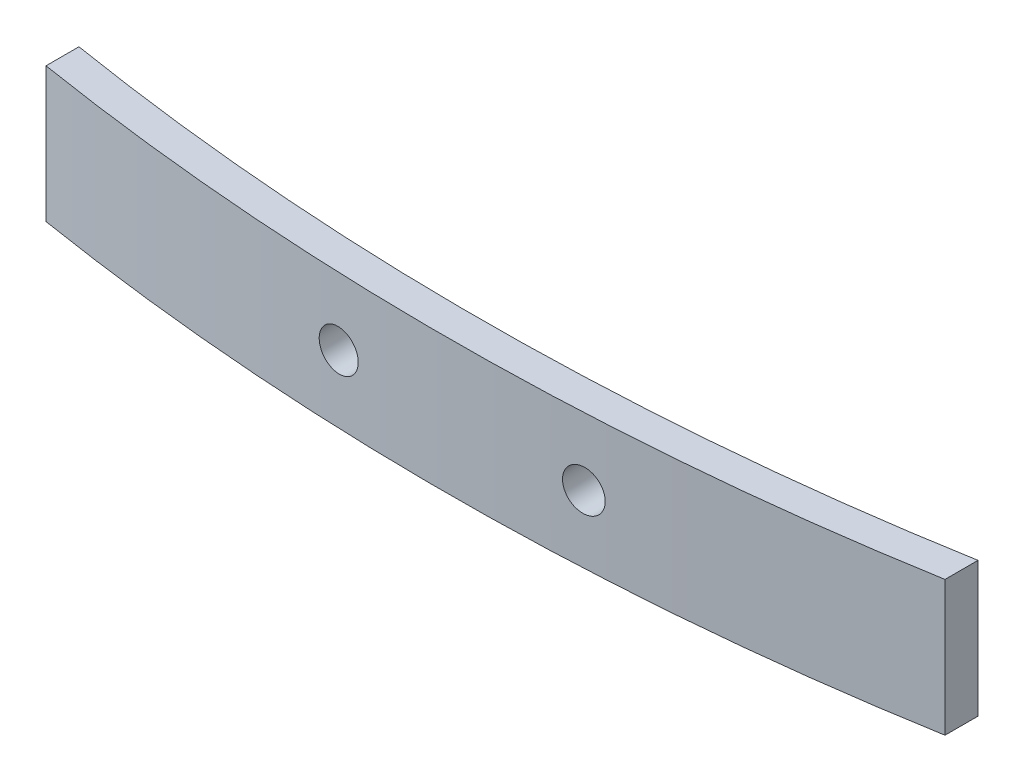
ISO-10303-21;
HEADER;
FILE_DESCRIPTION(('STEP AP214'),'2;1');
FILE_NAME('part.step','',(''),(''),'','','');
FILE_SCHEMA(('AUTOMOTIVE_DESIGN { 1 0 10303 214 1 1 1 1 }'));
ENDSEC;
DATA;
#1=APPLICATION_CONTEXT('core data for automotive mechanical design processes');
#2=APPLICATION_PROTOCOL_DEFINITION('international standard','automotive_design',2000,#1);
#3=PRODUCT_CONTEXT('',#1,'mechanical');
#4=PRODUCT('Part','Part','',(#3));
#5=PRODUCT_RELATED_PRODUCT_CATEGORY('part','',(#4));
#6=PRODUCT_DEFINITION_FORMATION('','',#4);
#7=PRODUCT_DEFINITION_CONTEXT('part definition',#1,'design');
#8=PRODUCT_DEFINITION('design','',#6,#7);
#9=PRODUCT_DEFINITION_SHAPE('','',#8);
#10=(LENGTH_UNIT() NAMED_UNIT(*) SI_UNIT(.MILLI.,.METRE.));
#11=(NAMED_UNIT(*) PLANE_ANGLE_UNIT() SI_UNIT($,.RADIAN.));
#12=(NAMED_UNIT(*) SI_UNIT($,.STERADIAN.) SOLID_ANGLE_UNIT());
#13=UNCERTAINTY_MEASURE_WITH_UNIT(LENGTH_MEASURE(1.E-05),#10,'distance_accuracy_value','');
#14=(GEOMETRIC_REPRESENTATION_CONTEXT(3) GLOBAL_UNCERTAINTY_ASSIGNED_CONTEXT((#13)) GLOBAL_UNIT_ASSIGNED_CONTEXT((#10,
#11,#12)) REPRESENTATION_CONTEXT('',''));
#15=CARTESIAN_POINT('',(0.,0.,0.));
#16=DIRECTION('',(0.,0.,1.));
#17=DIRECTION('',(1.,0.,0.));
#18=AXIS2_PLACEMENT_3D('',#15,#16,#17);
#19=CARTESIAN_POINT('',(-0.864955357142889,8.3,-164.510629845203));
#20=DIRECTION('',(0.,-1.,0.));
#21=DIRECTION('',(0.,0.,-1.));
#22=AXIS2_PLACEMENT_3D('',#19,#20,#21);
#23=CYLINDRICAL_SURFACE('',#22,165.210703971618);
#24=CARTESIAN_POINT('',(8.75,4.15,0.420050564105878));
#25=CARTESIAN_POINT('',(8.7499968756701,4.22012785151778,0.420050786641391));
#26=CARTESIAN_POINT('',(8.74407852912759,4.29030657591266,0.420396098331582));
#27=CARTESIAN_POINT('',(8.72055304510893,4.42872948848566,0.421764998652113));
#28=CARTESIAN_POINT('',(8.70293184075388,4.49697124536185,0.422789403552308));
#29=CARTESIAN_POINT('',(8.65650809093418,4.62949303841441,0.425475899042389));
#30=CARTESIAN_POINT('',(8.62771132313101,4.69377510184941,0.427137660119922));
#31=CARTESIAN_POINT('',(8.55976687690109,4.81657159404113,0.431033993499513));
#32=CARTESIAN_POINT('',(8.52062172919151,4.87508742814449,0.433268425749609));
#33=CARTESIAN_POINT('',(8.43305223614725,4.98477091182553,0.438227928441563));
#34=CARTESIAN_POINT('',(8.38461943762333,5.0359317924697,0.440953445708677));
#35=CARTESIAN_POINT('',(8.27987264209871,5.12940091687988,0.446793671892669));
#36=CARTESIAN_POINT('',(8.22355827497798,5.17170874467183,0.449908399086186));
#37=CARTESIAN_POINT('',(8.10455421106636,5.24633687235545,0.456421883334665));
#38=CARTESIAN_POINT('',(8.04185485362085,5.27864172993917,0.459821069355649));
#39=CARTESIAN_POINT('',(7.91193085692122,5.3322656283006,0.466784376452274));
#40=CARTESIAN_POINT('',(7.84470619336023,5.35358461006432,0.470348498413807));
#41=CARTESIAN_POINT('',(7.70755407236171,5.38465422269091,0.47753187341042));
#42=CARTESIAN_POINT('',(7.63762353654749,5.39439125228122,0.481151186219383));
#43=CARTESIAN_POINT('',(7.49711770071093,5.40197506678777,0.488331935567919));
#44=CARTESIAN_POINT('',(7.42654240018963,5.39982184250167,0.491893372062698));
#45=CARTESIAN_POINT('',(7.28673057784616,5.38368125095752,0.498859654116249));
#46=CARTESIAN_POINT('',(7.21749442510811,5.36969066742186,0.50226445685162));
#47=CARTESIAN_POINT('',(7.0823491009662,5.33026368881494,0.508828518634869));
#48=CARTESIAN_POINT('',(7.01643992557216,5.30482730747152,0.511987777977241));
#49=CARTESIAN_POINT('',(6.8898629668437,5.24324445263167,0.517984389992272));
#50=CARTESIAN_POINT('',(6.82919212444487,5.20710428528416,0.520821930848433));
#51=CARTESIAN_POINT('',(6.71477797427487,5.12513018115386,0.526116471355506));
#52=CARTESIAN_POINT('',(6.66103462822729,5.07929629793533,0.52857347310902));
#53=CARTESIAN_POINT('',(6.56206132205862,4.97928608662616,0.533057060848424));
#54=CARTESIAN_POINT('',(6.51682265931467,4.92511839069348,0.535084087092821));
#55=CARTESIAN_POINT('',(6.43608202244562,4.80994284773568,0.538675511251535));
#56=CARTESIAN_POINT('',(6.40057999610528,4.74893503739491,0.540239911646806));
#57=CARTESIAN_POINT('',(6.340357933409,4.62187706871117,0.542879900415455));
#58=CARTESIAN_POINT('',(6.31562712260273,4.55583202720676,0.543955977304391));
#59=CARTESIAN_POINT('',(6.27760214546197,4.42052190669178,0.545605857793076));
#60=CARTESIAN_POINT('',(6.26430793152615,4.35125684108483,0.546179663483375));
#61=CARTESIAN_POINT('',(6.24954097440456,4.21152203853996,0.546816834887879));
#62=CARTESIAN_POINT('',(6.24806041369155,4.14105312917926,0.546880538155649));
#63=CARTESIAN_POINT('',(6.25694243045685,4.00086716847885,0.546497531082771));
#64=CARTESIAN_POINT('',(6.26730498629387,3.93115011576549,0.546050821674816));
#65=CARTESIAN_POINT('',(6.29957441132196,3.79445965589939,0.544653251256617));
#66=CARTESIAN_POINT('',(6.3214792062226,3.72748575809605,0.543702480832502));
#67=CARTESIAN_POINT('',(6.37620694922726,3.59816781419316,0.541310528570389));
#68=CARTESIAN_POINT('',(6.40902990399195,3.5358237709181,0.539869346433213));
#69=CARTESIAN_POINT('',(6.48467114761501,3.4175119277289,0.536518343609078));
#70=CARTESIAN_POINT('',(6.52749274492063,3.36154624749035,0.534608367792417));
#71=CARTESIAN_POINT('',(6.62190587875572,3.25759845060247,0.530352467316842));
#72=CARTESIAN_POINT('',(6.6734974488955,3.2096163645511,0.528006540987174));
#73=CARTESIAN_POINT('',(6.78402732919472,3.1229563323932,0.522920767674274));
#74=CARTESIAN_POINT('',(6.8429713797798,3.08428572609344,0.520180612638965));
#75=CARTESIAN_POINT('',(6.96649912462997,3.01738774672038,0.51436476411554));
#76=CARTESIAN_POINT('',(7.03108284432829,2.98916042074618,0.511289069114225));
#77=CARTESIAN_POINT('',(7.16412839034453,2.94391857326429,0.504869298035268));
#78=CARTESIAN_POINT('',(7.23259422327701,2.92691587381022,0.501524943142095));
#79=CARTESIAN_POINT('',(7.37140001377697,2.90464748821122,0.494654869625039));
#80=CARTESIAN_POINT('',(7.44173998602875,2.89938189405638,0.491129149579919));
#81=CARTESIAN_POINT('',(7.58236818374903,2.90073434853974,0.483989440786617));
#82=CARTESIAN_POINT('',(7.65265629683359,2.90736367487349,0.480375371478415));
#83=CARTESIAN_POINT('',(7.79112055707237,2.9323391674771,0.473168949725147));
#84=CARTESIAN_POINT('',(7.85929669259729,2.95068539825232,0.469576597399751));
#85=CARTESIAN_POINT('',(7.99162839490877,2.99858567305698,0.462525628244137));
#86=CARTESIAN_POINT('',(8.05578240324823,3.02814403053687,0.459067063448729));
#87=CARTESIAN_POINT('',(8.17821506459887,3.09763191261792,0.452400980172808));
#88=CARTESIAN_POINT('',(8.23649395687128,3.13756101463856,0.449193451470164));
#89=CARTESIAN_POINT('',(8.34548259383017,3.22663160990741,0.44314404983962));
#90=CARTESIAN_POINT('',(8.39619733991694,3.27576696706239,0.440301935473491));
#91=CARTESIAN_POINT('',(8.4886680570718,3.38189249727254,0.435084215694026));
#92=CARTESIAN_POINT('',(8.5304218580004,3.43888456757103,0.432708723297815));
#93=CARTESIAN_POINT('',(8.60372478212185,3.55903320833602,0.428516976642925));
#94=CARTESIAN_POINT('',(8.6352829269122,3.62218426425832,0.426700228050157));
#95=CARTESIAN_POINT('',(8.68731128395109,3.75285295151056,0.423695249568875));
#96=CARTESIAN_POINT('',(8.70779492398493,3.82036518318595,0.42250625856843));
#97=CARTESIAN_POINT('',(8.73161237551989,3.93192617529781,0.421121713201916));
#98=CARTESIAN_POINT('',(8.73849904429465,3.97524605096882,0.420720697745667));
#99=CARTESIAN_POINT('',(8.74769383053028,4.06237066227353,0.420185053794006));
#100=CARTESIAN_POINT('',(8.75000195246986,4.1061753974329,0.420050425038016));
#101=CARTESIAN_POINT('',(8.75,4.15,0.420050564105878));
#102=B_SPLINE_CURVE_WITH_KNOTS('',3,(#24,#25,#26,#27,#28,#29,#30,#31,#32,#33,#34,#35,#36,#37,
#38,#39,#40,#41,#42,#43,#44,#45,#46,#47,#48,#49,#50,#51,#52,#53,#54,#55,#56,#57,#58,#59,#60,#61,
#62,#63,#64,#65,#66,#67,#68,#69,#70,#71,#72,#73,#74,#75,#76,#77,#78,#79,#80,#81,#82,#83,#84,#85,
#86,#87,#88,#89,#90,#91,#92,#93,#94,#95,#96,#97,#98,#99,#100,#101),.UNSPECIFIED.,.T.,.F.,(4,2,2,
2,2,2,2,2,2,2,2,2,2,2,2,2,2,2,2,2,2,2,2,2,2,2,2,2,2,2,2,2,2,2,2,2,2,2,4),(0.,0.210223445977021,
0.420700039769353,0.63106796378494,0.84138448941568,1.0518933518043,1.26241210304978,
1.47325424539596,1.68409752033319,1.89518815550945,2.10627895405728,2.31742712559701,
2.52857504389096,2.73959881074264,2.95062141157759,3.16142688888051,3.37223123566221,
3.58282422776111,3.79341634332708,4.00386909080652,4.21432145372016,4.42473600850072,
4.63515069164558,4.84563509774261,5.05612031052455,5.26677089982141,5.47742243913898,
5.68829548939093,5.89917019236428,6.11024493345311,6.32132083658665,6.53247802584897,
6.74362661236154,6.95463496292118,7.16569435743921,7.37656648187794,7.58718234815398,
7.71855622861525,7.84992998056732),.UNSPECIFIED.);
#103=CARTESIAN_POINT('',(8.75,4.15,0.420050564105878));
#104=VERTEX_POINT('',#103);
#105=EDGE_CURVE('E120',#104,#104,#102,.T.);
#106=ORIENTED_EDGE('',*,*,#105,.T.);
#107=EDGE_LOOP('',(#106));
#108=FACE_BOUND('',#107,.T.);
#109=CARTESIAN_POINT('',(-6.25,4.15,0.612288009926576));
#110=CARTESIAN_POINT('',(-6.25000311571131,4.22018355239191,0.612287948701788));
#111=CARTESIAN_POINT('',(-6.25593075978931,4.2904179787371,0.612094924403042));
#112=CARTESIAN_POINT('',(-6.27949447756528,4.42895209563307,0.611323893589473));
#113=CARTESIAN_POINT('',(-6.2971446367521,4.49724935546489,0.610745423930163));
#114=CARTESIAN_POINT('',(-6.34364908837448,4.62988168369549,0.60920893853824));
#115=CARTESIAN_POINT('',(-6.37249792853421,4.69421866259394,0.608251107499823));
#116=CARTESIAN_POINT('',(-6.44057119968027,4.81711670051832,0.605966440329411));
#117=CARTESIAN_POINT('',(-6.47979305791574,4.87567918681573,0.604639695692422));
#118=CARTESIAN_POINT('',(-6.56751337852462,4.9854062839793,0.601633356485876));
#119=CARTESIAN_POINT('',(-6.61601467183209,5.03656862885316,0.599953654221962));
#120=CARTESIAN_POINT('',(-6.72090916987377,5.13002658482638,0.596266618886531));
#121=CARTESIAN_POINT('',(-6.77730270118661,5.17232182882653,0.594259272256608));
#122=CARTESIAN_POINT('',(-6.89640796884524,5.24686589631549,0.589951115896844));
#123=CARTESIAN_POINT('',(-6.95912282670767,5.27910972386023,0.587650161030504));
#124=CARTESIAN_POINT('',(-7.08906630444559,5.3326117277739,0.582802406813894));
#125=CARTESIAN_POINT('',(-7.15629493167516,5.35386988624392,0.580255607063079));
#126=CARTESIAN_POINT('',(-7.29340442194187,5.38481197096959,0.574973575011229));
#127=CARTESIAN_POINT('',(-7.36328700154222,5.39448826991545,0.572238219788182));
#128=CARTESIAN_POINT('',(-7.50368007668842,5.4019696691906,0.56665198267269));
#129=CARTESIAN_POINT('',(-7.57419057342636,5.39977474697769,0.563801100560882));
#130=CARTESIAN_POINT('',(-7.71387945362295,5.38357292521863,0.558064449045412));
#131=CARTESIAN_POINT('',(-7.78305707886924,5.36955949439595,0.555178661221106));
#132=CARTESIAN_POINT('',(-7.91807733611011,5.33010934361725,0.549464502868027));
#133=CARTESIAN_POINT('',(-7.98391995872912,5.30467259154923,0.546636132500682));
#134=CARTESIAN_POINT('',(-8.11040870949573,5.24309180134629,0.54113211185841));
#135=CARTESIAN_POINT('',(-8.17105421102282,5.20694647440621,0.538456480012222));
#136=CARTESIAN_POINT('',(-8.28541568787778,5.12497267595302,0.533354465386389));
#137=CARTESIAN_POINT('',(-8.33913167949136,5.07914422719782,0.530928082020964));
#138=CARTESIAN_POINT('',(-8.43807894852099,4.97912832988149,0.526417399872258));
#139=CARTESIAN_POINT('',(-8.4833145581676,4.92494517527411,0.524332926491592));
#140=CARTESIAN_POINT('',(-8.56404495416109,4.80973912005988,0.520586488920758));
#141=CARTESIAN_POINT('',(-8.59953979122227,4.74871625506557,0.518924522530854));
#142=CARTESIAN_POINT('',(-8.65974439972634,4.6216271240783,0.516091877374447));
#143=CARTESIAN_POINT('',(-8.68446475412751,4.55556588220122,0.514920716570525));
#144=CARTESIAN_POINT('',(-8.72246441910089,4.42022399273247,0.513115788962741));
#145=CARTESIAN_POINT('',(-8.73574379707123,4.35094336410855,0.512482018993142));
#146=CARTESIAN_POINT('',(-8.75047458862379,4.2111980915843,0.511778780959092));
#147=CARTESIAN_POINT('',(-8.75193694008761,4.14073460310761,0.511708791058002));
#148=CARTESIAN_POINT('',(-8.74302066539331,4.0005626973153,0.512134684324352));
#149=CARTESIAN_POINT('',(-8.73264207065434,3.93085427799663,0.512630565990288));
#150=CARTESIAN_POINT('',(-8.70034544962065,3.79419204857333,0.514167162544728));
#151=CARTESIAN_POINT('',(-8.67843080347073,3.7272374377756,0.515207717839497));
#152=CARTESIAN_POINT('',(-8.62368951853576,3.59795898046812,0.517790426931301));
#153=CARTESIAN_POINT('',(-8.5908628581906,3.5356351431082,0.519332581719403));
#154=CARTESIAN_POINT('',(-8.51521227384373,3.41735055124752,0.522856772119375));
#155=CARTESIAN_POINT('',(-8.47238306461757,3.36139318403883,0.524839040254345));
#156=CARTESIAN_POINT('',(-8.3779548356778,3.25746147580423,0.52916466983499));
#157=CARTESIAN_POINT('',(-8.32635576524137,3.20948718095373,0.53150803336915));
#158=CARTESIAN_POINT('',(-8.21579579794787,3.12283180802716,0.536469223168007));
#159=CARTESIAN_POINT('',(-8.15682751540769,3.08416016875794,0.539087324356433));
#160=CARTESIAN_POINT('',(-8.03324331961947,3.01726497292627,0.544500869169606));
#161=CARTESIAN_POINT('',(-7.96862738257522,2.98904146038931,0.54729631354157));
#162=CARTESIAN_POINT('',(-7.8355196571947,2.94381943465548,0.552971163005119));
#163=CARTESIAN_POINT('',(-7.76702449530367,2.92683085980956,0.555850640087179));
#164=CARTESIAN_POINT('',(-7.62815314481567,2.90459979079998,0.561598861621528));
#165=CARTESIAN_POINT('',(-7.55777694822369,2.89935734656927,0.56446760602814));
#166=CARTESIAN_POINT('',(-7.41711753048462,2.90076871395252,0.570110501825141));
#167=CARTESIAN_POINT('',(-7.34683434598474,2.90742630602083,0.572884622869849));
#168=CARTESIAN_POINT('',(-7.20837958754747,2.93245878709451,0.578262808404094));
#169=CARTESIAN_POINT('',(-7.14020801585102,2.95083368853438,0.580866872713163));
#170=CARTESIAN_POINT('',(-7.00793228027882,2.99877590873363,0.585841723492785));
#171=CARTESIAN_POINT('',(-6.94382705094201,3.02834028137105,0.588212571161069));
#172=CARTESIAN_POINT('',(-6.82149085700399,3.09782436801472,0.592671585008919));
#173=CARTESIAN_POINT('',(-6.76325964443876,3.13774364464784,0.594759763122288));
#174=CARTESIAN_POINT('',(-6.65436671082572,3.22677356012875,0.598613974910926));
#175=CARTESIAN_POINT('',(-6.60369956033725,3.27587754864781,0.600380239856697));
#176=CARTESIAN_POINT('',(-6.51131557625305,3.38191903380727,0.603565383454509));
#177=CARTESIAN_POINT('',(-6.46960094041181,3.43885844835036,0.604984176817727));
#178=CARTESIAN_POINT('',(-6.39633408535729,3.55892548464134,0.607454882195936));
#179=CARTESIAN_POINT('',(-6.36478028832285,3.62205214361811,0.608506851175186));
#180=CARTESIAN_POINT('',(-6.31275419768299,3.75266197816612,0.610231582461443));
#181=CARTESIAN_POINT('',(-6.29226858560104,3.82013980793337,0.610904800564288));
#182=CARTESIAN_POINT('',(-6.26842481149668,3.93170707646447,0.61168634008723));
#183=CARTESIAN_POINT('',(-6.26152415895528,3.9750705609376,0.611911843000679));
#184=CARTESIAN_POINT('',(-6.25231078003501,4.06228273831287,0.612212697036015));
#185=CARTESIAN_POINT('',(-6.24999805250957,4.10613143109375,0.612288048195426));
#186=CARTESIAN_POINT('',(-6.25,4.15,0.612288009926576));
#187=B_SPLINE_CURVE_WITH_KNOTS('',3,(#109,#110,#111,#112,#113,#114,#115,#116,#117,#118,#119,
#120,#121,#122,#123,#124,#125,#126,#127,#128,#129,#130,#131,#132,#133,#134,#135,#136,#137,#138,
#139,#140,#141,#142,#143,#144,#145,#146,#147,#148,#149,#150,#151,#152,#153,#154,#155,#156,#157,
#158,#159,#160,#161,#162,#163,#164,#165,#166,#167,#168,#169,#170,#171,#172,#173,#174,#175,#176,
#177,#178,#179,#180,#181,#182,#183,#184,#185,#186),.UNSPECIFIED.,.T.,.F.,(4,2,2,2,2,2,2,2,2,2,2,
2,2,2,2,2,2,2,2,2,2,2,2,2,2,2,2,2,2,2,2,2,2,2,2,2,2,2,4),(0.,0.210390503068588,
0.421034264711717,0.631575599082518,0.842064763174761,1.05261824517612,1.26318044240039,
1.47384713095046,1.68451416273795,1.89531985448584,2.10612594653145,2.3170486129942,
2.52797187238342,2.7389205272615,2.94986868635966,3.16070878649296,3.37154778888909,
3.58217923083019,3.79280943194546,4.00324465064315,4.21367931096638,4.42405234673518,
4.63442579816419,4.84491066085422,5.05539674098095,5.26609549541984,5.47679513767428,
5.6876809150019,5.89856758880574,6.10952126989617,6.32047517485255,6.53137357548215,
6.74226306958042,6.95300045295797,7.1637895112675,7.37454582149352,7.58504795814686,
7.71655359263122,7.8480591942506),.UNSPECIFIED.);
#188=CARTESIAN_POINT('',(-6.25,4.15,0.612288009926576));
#189=VERTEX_POINT('',#188);
#190=EDGE_CURVE('E137',#189,#189,#187,.T.);
#191=ORIENTED_EDGE('',*,*,#190,.T.);
#192=EDGE_LOOP('',(#191));
#193=FACE_BOUND('',#192,.T.);
#194=CARTESIAN_POINT('',(-0.864955357142889,0.,-164.510629845203));
#195=DIRECTION('',(0.,-1.,0.));
#196=DIRECTION('',(0.,0.,1.));
#197=AXIS2_PLACEMENT_3D('',#194,#195,#196);
#198=CIRCLE('',#197,165.210703971618);
#199=CARTESIAN_POINT('',(27.5,0.,-1.75312306169167));
#200=VERTEX_POINT('',#199);
#201=CARTESIAN_POINT('',(-27.5,0.,-1.4610941093707));
#202=VERTEX_POINT('',#201);
#203=EDGE_CURVE('E116',#200,#202,#198,.T.);
#204=ORIENTED_EDGE('',*,*,#203,.T.);
#205=DIRECTION('',(0.,-1.,0.));
#206=VECTOR('',#205,1.);
#207=CARTESIAN_POINT('',(-27.5,8.3,-1.4610941093707));
#208=LINE('',#207,#206);
#209=CARTESIAN_POINT('',(-27.5,8.3,-1.4610941093707));
#210=VERTEX_POINT('',#209);
#211=EDGE_CURVE('E11',#210,#202,#208,.T.);
#212=ORIENTED_EDGE('',*,*,#211,.F.);
#213=CARTESIAN_POINT('',(-0.864955357142889,8.3,-164.510629845203));
#214=DIRECTION('',(0.,-1.,0.));
#215=DIRECTION('',(0.,0.,1.));
#216=AXIS2_PLACEMENT_3D('',#213,#214,#215);
#217=CIRCLE('',#216,165.210703971618);
#218=CARTESIAN_POINT('',(27.5,8.3,-1.75312306169167));
#219=VERTEX_POINT('',#218);
#220=EDGE_CURVE('E99',#219,#210,#217,.T.);
#221=ORIENTED_EDGE('',*,*,#220,.F.);
#222=DIRECTION('',(0.,-1.,0.));
#223=VECTOR('',#222,1.);
#224=CARTESIAN_POINT('',(27.5,8.3,-1.75312306169167));
#225=LINE('',#224,#223);
#226=EDGE_CURVE('E112',#219,#200,#225,.T.);
#227=ORIENTED_EDGE('',*,*,#226,.T.);
#228=EDGE_LOOP('',(#204,#212,#221,#227));
#229=FACE_BOUND('',#228,.T.);
#230=ADVANCED_FACE('F39',(#108,#193,#229),#23,.F.);
#231=CARTESIAN_POINT('',(-27.5,8.3,-1.4610941093707));
#232=DIRECTION('',(1.,0.,0.));
#233=DIRECTION('',(0.,0.,-1.));
#234=AXIS2_PLACEMENT_3D('',#231,#232,#233);
#235=PLANE('',#234);
#236=DIRECTION('',(0.,0.,1.));
#237=VECTOR('',#236,1.);
#238=CARTESIAN_POINT('',(-27.5,0.,-1.4610941093707));
#239=LINE('',#238,#237);
#240=CARTESIAN_POINT('',(-27.5000000000001,0.,0.565091929856765));
#241=VERTEX_POINT('',#240);
#242=EDGE_CURVE('E104',#202,#241,#239,.T.);
#243=ORIENTED_EDGE('',*,*,#242,.T.);
#244=DIRECTION('',(0.,-1.,0.));
#245=VECTOR('',#244,1.);
#246=CARTESIAN_POINT('',(-27.5000000000001,8.3,0.565091929856765));
#247=LINE('',#246,#245);
#248=CARTESIAN_POINT('',(-27.5000000000001,8.3,0.565091929856765));
#249=VERTEX_POINT('',#248);
#250=EDGE_CURVE('E55',#249,#241,#247,.T.);
#251=ORIENTED_EDGE('',*,*,#250,.F.);
#252=DIRECTION('',(0.,0.,1.));
#253=VECTOR('',#252,1.);
#254=CARTESIAN_POINT('',(-27.5,8.3,-1.4610941093707));
#255=LINE('',#254,#253);
#256=EDGE_CURVE('E94',#210,#249,#255,.T.);
#257=ORIENTED_EDGE('',*,*,#256,.F.);
#258=ORIENTED_EDGE('',*,*,#211,.T.);
#259=EDGE_LOOP('',(#243,#251,#257,#258));
#260=FACE_BOUND('',#259,.T.);
#261=ADVANCED_FACE('F103',(#260),#235,.F.);
#262=CARTESIAN_POINT('',(-0.864955357142889,8.3,-164.510629845203));
#263=DIRECTION('',(0.,-1.,0.));
#264=DIRECTION('',(0.,0.,-1.));
#265=AXIS2_PLACEMENT_3D('',#262,#263,#264);
#266=CYLINDRICAL_SURFACE('',#265,167.210703971618);
#267=CARTESIAN_POINT('',(8.75,4.15,2.42340549859402));
#268=CARTESIAN_POINT('',(8.7499968759262,4.07987012137044,2.42340571844582));
#269=CARTESIAN_POINT('',(8.74407819084325,4.00968936898739,2.42374690560114));
#270=CARTESIAN_POINT('',(8.72055131717487,3.87126241398294,2.42509945786629));
#271=CARTESIAN_POINT('',(8.70292906080826,3.80301864269076,2.42611162950184));
#272=CARTESIAN_POINT('',(8.65650238633006,3.67049285173357,2.4287660522962));
#273=CARTESIAN_POINT('',(8.62770373590653,3.60620880840686,2.43040797845888));
#274=CARTESIAN_POINT('',(8.55975462355993,3.48340863823658,2.43425781776977));
#275=CARTESIAN_POINT('',(8.52060669359667,3.42489110541184,2.43646559247862));
#276=CARTESIAN_POINT('',(8.43303156162517,3.31520582991078,2.44136589382248));
#277=CARTESIAN_POINT('',(8.38459608361104,3.26404471412625,2.44405885266811));
#278=CARTESIAN_POINT('',(8.27984339346623,3.17057563894572,2.44982931904001));
#279=CARTESIAN_POINT('',(8.22352581262794,3.12826809393164,2.45290684455476));
#280=CARTESIAN_POINT('',(8.10451714174231,3.05364269118637,2.45934241559074));
#281=CARTESIAN_POINT('',(8.041816623435,3.02133990455394,2.46270087473628));
#282=CARTESIAN_POINT('',(7.91189047346441,2.96772029239522,2.46958074239435));
#283=CARTESIAN_POINT('',(7.84466481828969,2.9464035239544,2.4731021517535));
#284=CARTESIAN_POINT('',(7.70751294966958,2.91533895910661,2.48019932744157));
#285=CARTESIAN_POINT('',(7.63758373153518,2.90560444024127,2.48377515140502));
#286=CARTESIAN_POINT('',(7.49708099898386,2.89802511241837,2.49086960284267));
#287=CARTESIAN_POINT('',(7.42650748410816,2.90018031192793,2.49438823027613));
#288=CARTESIAN_POINT('',(7.28670012554887,2.91632414244071,2.50127073842057));
#289=CARTESIAN_POINT('',(7.21746664220022,2.93031591229712,2.50463457783493));
#290=CARTESIAN_POINT('',(7.08232692497333,2.96974430691074,2.51111965594278));
#291=CARTESIAN_POINT('',(7.01642068728273,2.99518091855414,2.51424089491422));
#292=CARTESIAN_POINT('',(6.88984875734409,3.05676359416933,2.520165375863));
#293=CARTESIAN_POINT('',(6.82918007858731,3.09290350222251,2.52296879935137));
#294=CARTESIAN_POINT('',(6.71477020629758,3.17487622745391,2.52819967652553));
#295=CARTESIAN_POINT('',(6.66102897533549,3.22070899225789,2.53062713224269));
#296=CARTESIAN_POINT('',(6.56205835230829,3.32071733576925,2.53505686160251));
#297=CARTESIAN_POINT('',(6.51682046506705,3.37488448861664,2.5370595598542));
#298=CARTESIAN_POINT('',(6.43608126204884,3.49005848772344,2.54060787994089));
#299=CARTESIAN_POINT('',(6.40057989533456,3.55106529819833,2.54215350416711));
#300=CARTESIAN_POINT('',(6.34035812216981,3.67812241017294,2.54476184415459));
#301=CARTESIAN_POINT('',(6.31562719806153,3.7441677170099,2.545825031073));
#302=CARTESIAN_POINT('',(6.2776020971927,3.87947825233901,2.54745514622849));
#303=CARTESIAN_POINT('',(6.26430787395331,3.94874346774423,2.54802207648237));
#304=CARTESIAN_POINT('',(6.24954082405741,4.08847961995922,2.54865161672816));
#305=CARTESIAN_POINT('',(6.24806036595877,4.15894974892714,2.54871455229005));
#306=CARTESIAN_POINT('',(6.25694299560165,4.29913811959953,2.54833610858745));
#307=CARTESIAN_POINT('',(6.2673060622287,4.36885636264422,2.54789473022203));
#308=CARTESIAN_POINT('',(6.29957701281969,4.50554944308895,2.54651384125092));
#309=CARTESIAN_POINT('',(6.321482871838,4.57252475945876,2.54557441801678));
#310=CARTESIAN_POINT('',(6.3762133200028,4.70184538321581,2.54321101100255));
#311=CARTESIAN_POINT('',(6.40903791561766,4.76419068786017,2.54178702693539));
#312=CARTESIAN_POINT('',(6.48468275935071,4.88250430561797,2.53847602046889));
#313=CARTESIAN_POINT('',(6.52750623741589,4.9384705493861,2.53658884843546));
#314=CARTESIAN_POINT('',(6.6219236312372,5.04241915222049,2.5323837556043));
#315=CARTESIAN_POINT('',(6.67351757989245,5.09040148133676,2.53006583319077));
#316=CARTESIAN_POINT('',(6.78405166747195,5.17706068505861,2.5250408107236));
#317=CARTESIAN_POINT('',(6.84299741070677,5.21573039397914,2.52233341352717));
#318=CARTESIAN_POINT('',(6.96652874466183,5.28262627072503,2.51658709195815));
#319=CARTESIAN_POINT('',(7.03111436007255,5.31085239282717,2.51354816613418));
#320=CARTESIAN_POINT('',(7.16416214246729,5.35609080416202,2.5072052239132));
#321=CARTESIAN_POINT('',(7.23262822078288,5.37309155233608,2.50390093859557));
#322=CARTESIAN_POINT('',(7.37143437970747,5.39535605206446,2.49711318891029));
#323=CARTESIAN_POINT('',(7.44177447473131,5.40061971331127,2.4936297231642));
#324=CARTESIAN_POINT('',(7.58240109739181,5.39926339313341,2.4865756781979));
#325=CARTESIAN_POINT('',(7.65268751511746,5.39263240341705,2.48300502130082));
#326=CARTESIAN_POINT('',(7.79114816585301,5.36765414255638,2.4758851856896));
#327=CARTESIAN_POINT('',(7.8593223874094,5.34930680789114,2.47233600709202));
#328=CARTESIAN_POINT('',(7.99164948058039,5.30140518650286,2.46536983325012));
#329=CARTESIAN_POINT('',(8.05580082929915,5.27184668517906,2.46195288824924));
#330=CARTESIAN_POINT('',(8.17822818102457,5.20235946919012,2.45536704386843));
#331=CARTESIAN_POINT('',(8.23650442308893,5.16243117670771,2.45219813439712));
#332=CARTESIAN_POINT('',(8.34548871241756,5.07336264520676,2.44622154154585));
#333=CARTESIAN_POINT('',(8.39620166121003,5.02422841925977,2.44341362438258));
#334=CARTESIAN_POINT('',(8.48866906289056,4.91810600261773,2.43825869201561));
#335=CARTESIAN_POINT('',(8.53042134428022,4.86111591364173,2.43591178854408));
#336=CARTESIAN_POINT('',(8.60372300458297,4.74097006582692,2.43177041236711));
#337=CARTESIAN_POINT('',(8.63528107441361,4.67781961903462,2.42997546915955));
#338=CARTESIAN_POINT('',(8.68730942116913,4.54715249425469,2.42700655200385));
#339=CARTESIAN_POINT('',(8.70779312246654,4.4796412141712,2.4258318262675));
#340=CARTESIAN_POINT('',(8.73161132337617,4.36808002854529,2.42446385353792));
#341=CARTESIAN_POINT('',(8.7384983882257,4.32475891370707,2.42406762781941));
#342=CARTESIAN_POINT('',(8.74769370050571,4.23763182151305,2.4235383817778));
#343=CARTESIAN_POINT('',(8.75000195230871,4.1938258446203,2.42340536120334));
#344=CARTESIAN_POINT('',(8.75,4.15,2.42340549859402));
#345=B_SPLINE_CURVE_WITH_KNOTS('',3,(#267,#268,#269,#270,#271,#272,#273,#274,#275,#276,#277,
#278,#279,#280,#281,#282,#283,#284,#285,#286,#287,#288,#289,#290,#291,#292,#293,#294,#295,#296,
#297,#298,#299,#300,#301,#302,#303,#304,#305,#306,#307,#308,#309,#310,#311,#312,#313,#314,#315,
#316,#317,#318,#319,#320,#321,#322,#323,#324,#325,#326,#327,#328,#329,#330,#331,#332,#333,#334,
#335,#336,#337,#338,#339,#340,#341,#342,#343,#344),.UNSPECIFIED.,.T.,.F.,(4,2,2,2,2,2,2,2,2,2,2,
2,2,2,2,2,2,2,2,2,2,2,2,2,2,2,2,2,2,2,2,2,2,2,2,2,2,2,4),(0.,0.210229526330766,
0.420712208603477,0.631086413349326,0.841409197426138,1.05192027556956,1.26244120425612,
1.47327773487148,1.684115361023,1.89519445291078,2.10627369511606,2.31740892942866,
2.52854392181756,2.7395577165822,2.95057037118733,3.16137108216245,3.37217069029722,
3.58276398222082,3.79335641828739,4.00381280507794,4.21426881667042,4.42468792036776,
4.63510714871938,4.84559444323099,5.0560825273238,5.26673205968139,5.47738251427596,
5.68824920749127,5.89911752315157,6.11018109445236,6.32124581005774,6.53238994974381,
6.74352549451837,6.95452360890835,7.16557279828773,7.37644158314923,7.58705417601551,
7.71843177902917,7.84980925658394),.UNSPECIFIED.);
#346=CARTESIAN_POINT('',(8.75,4.15,2.42340549859402));
#347=VERTEX_POINT('',#346);
#348=EDGE_CURVE('E43',#347,#347,#345,.T.);
#349=ORIENTED_EDGE('',*,*,#348,.T.);
#350=EDGE_LOOP('',(#349));
#351=FACE_BOUND('',#350,.T.);
#352=CARTESIAN_POINT('',(-6.25,4.15,2.61333856411392));
#353=CARTESIAN_POINT('',(-6.25000311565992,4.07981574606103,2.61333850362465));
#354=CARTESIAN_POINT('',(-6.25593087719105,4.00958061729741,2.6131477867122));
#355=CARTESIAN_POINT('',(-6.27949507550797,3.87104510438208,2.61238597227616));
#356=CARTESIAN_POINT('',(-6.297145598251,3.80274715099205,2.61181441713833));
#357=CARTESIAN_POINT('',(-6.34365105592586,3.67011345543528,2.61029629603647));
#358=CARTESIAN_POINT('',(-6.37250054084197,3.60577580359118,2.60934991247952));
#359=CARTESIAN_POINT('',(-6.44057541610514,3.48287650486345,2.60709254775912));
#360=CARTESIAN_POINT('',(-6.4797982334516,3.42431343059236,2.60578165700387));
#361=CARTESIAN_POINT('',(-6.56752060650743,3.31458558372347,2.60281124515757));
#362=CARTESIAN_POINT('',(-6.61602294900017,3.26342304174476,2.60115161932128));
#363=CARTESIAN_POINT('',(-6.72091982579359,3.169964875977,2.5975086494016));
#364=CARTESIAN_POINT('',(-6.77731468628578,3.12766961884637,2.59552529193808));
#365=CARTESIAN_POINT('',(-6.89642214749191,3.05312628172291,2.59126864347545));
#366=CARTESIAN_POINT('',(-6.95913779281653,3.02088307452851,2.58899521261149));
#367=CARTESIAN_POINT('',(-7.08908295006164,2.96738245851538,2.58420544720456));
#368=CARTESIAN_POINT('',(-7.15631246894652,2.94612506664691,2.58168911228679));
#369=CARTESIAN_POINT('',(-7.2934227128282,2.91518499163511,2.5764703066392));
#370=CARTESIAN_POINT('',(-7.36330511368689,2.90550975498857,2.57376771734056));
#371=CARTESIAN_POINT('',(-7.50369776502639,2.89803039840271,2.56824840244642));
#372=CARTESIAN_POINT('',(-7.57420801664396,2.90022629996097,2.56543167664425));
#373=CARTESIAN_POINT('',(-7.71389536100917,2.91642989677656,2.55976380259775));
#374=CARTESIAN_POINT('',(-7.78307171352842,2.93044396776616,2.55691263659198));
#375=CARTESIAN_POINT('',(-7.91808934889109,2.96989498022109,2.55126704410276));
#376=CARTESIAN_POINT('',(-7.98393062249905,2.99533195331665,2.54847261777646));
#377=CARTESIAN_POINT('',(-8.11041645198137,3.05691261500473,2.54303467145691));
#378=CARTESIAN_POINT('',(-8.17106039634817,3.09305756125267,2.54039116923328));
#379=CARTESIAN_POINT('',(-8.28541885549217,3.175029992563,2.53535042867961));
#380=CARTESIAN_POINT('',(-8.33913338623508,3.22085745531573,2.53295318978217));
#381=CARTESIAN_POINT('',(-8.43807859434588,3.32087135476025,2.5284966624215));
#382=CARTESIAN_POINT('',(-8.48331350090785,3.37505359981427,2.52643720555466));
#383=CARTESIAN_POINT('',(-8.56404270602494,3.49025738791354,2.52273572913798));
#384=CARTESIAN_POINT('',(-8.59953705405136,3.55127889622064,2.52109370746803));
#385=CARTESIAN_POINT('',(-8.65974178650218,3.67836643118199,2.51829501245051));
#386=CARTESIAN_POINT('',(-8.68446250170708,3.74442755361697,2.51713787419193));
#387=CARTESIAN_POINT('',(-8.72246289000834,3.87976910315633,2.51535454955887));
#388=CARTESIAN_POINT('',(-8.73574262890663,3.94904951174283,2.51472836013067));
#389=CARTESIAN_POINT('',(-8.75047437058031,4.08879588610972,2.51403350758343));
#390=CARTESIAN_POINT('',(-8.75193705084305,4.15926072396618,2.51396434115775));
#391=CARTESIAN_POINT('',(-8.74302097445947,4.29943537547764,2.51438511956936));
#392=CARTESIAN_POINT('',(-8.73264224847514,4.36914519108721,2.51487506295889));
#393=CARTESIAN_POINT('',(-8.70034474469929,4.50581071281282,2.51639328094994));
#394=CARTESIAN_POINT('',(-8.67842926680251,4.57276720057096,2.51742140161439));
#395=CARTESIAN_POINT('',(-8.62368559505439,4.70204927590946,2.51997326186475));
#396=CARTESIAN_POINT('',(-8.59085738018815,4.76437485457169,2.52149700240508));
#397=CARTESIAN_POINT('',(-8.51520341465857,4.88266186717285,2.52497910253712));
#398=CARTESIAN_POINT('',(-8.47237250426532,4.93861999433292,2.52693768640997));
#399=CARTESIAN_POINT('',(-8.37794037154417,5.04255288839341,2.53121164028211));
#400=CARTESIAN_POINT('',(-8.32633909960902,5.09052761013476,2.53352701229948));
#401=CARTESIAN_POINT('',(-8.21577563837457,5.17718226167879,2.53842888642847));
#402=CARTESIAN_POINT('',(-8.15680623875195,5.21585297678,2.54101565371978));
#403=CARTESIAN_POINT('',(-8.03321979513085,5.28274613144361,2.54636440600295));
#404=CARTESIAN_POINT('',(-7.96860272804309,5.31096852828781,2.54912639171115));
#405=CARTESIAN_POINT('',(-7.83549424666815,5.3561875837718,2.55473325469572));
#406=CARTESIAN_POINT('',(-7.76699953930919,5.37317454066665,2.55757820140137));
#407=CARTESIAN_POINT('',(-7.62812938553602,5.39540260675064,2.56325748378831));
#408=CARTESIAN_POINT('',(-7.55775393123791,5.40064366669441,2.56609181942506));
#409=CARTESIAN_POINT('',(-7.41709683864988,5.39922983344184,2.57166700330105));
#410=CARTESIAN_POINT('',(-7.34681523622105,5.39257125069326,2.57440782227638));
#411=CARTESIAN_POINT('',(-7.20836386994777,5.36753735918785,2.57972143960436));
#412=CARTESIAN_POINT('',(-7.14019410839206,5.34916203773327,2.58229423777492));
#413=CARTESIAN_POINT('',(-7.00792165421107,5.30121947308366,2.58720937043567));
#414=CARTESIAN_POINT('',(-6.94381792318053,5.27165510095635,2.58955176385274));
#415=CARTESIAN_POINT('',(-6.8214847420781,5.20217159213611,2.59395725996007));
#416=CARTESIAN_POINT('',(-6.76325504445718,5.16225289205843,2.59602037442122));
#417=CARTESIAN_POINT('',(-6.65436417618515,5.07322407013564,2.59982835513281));
#418=CARTESIAN_POINT('',(-6.60369768662673,5.02412046295314,2.60157344522986));
#419=CARTESIAN_POINT('',(-6.511314947515,4.91808008217984,2.60472040388598));
#420=CARTESIAN_POINT('',(-6.46960089641142,4.86114139014878,2.60612218815136));
#421=CARTESIAN_POINT('',(-6.39633444475318,4.74107519374575,2.60856329527341));
#422=CARTESIAN_POINT('',(-6.36478061938567,4.67794855875706,2.60960266895418));
#423=CARTESIAN_POINT('',(-6.31275448682694,4.54733887617282,2.61130675000581));
#424=CARTESIAN_POINT('',(-6.29226886194857,4.47986117392516,2.61197190768783));
#425=CARTESIAN_POINT('',(-6.26842497106538,4.36829386498496,2.61274409320369));
#426=CARTESIAN_POINT('',(-6.26152425807603,4.32493018861701,2.61296689801317));
#427=CARTESIAN_POINT('',(-6.25231079937943,4.23771763349944,2.61326415235463));
#428=CARTESIAN_POINT('',(-6.24999805255291,4.1938687548682,2.61333860192281));
#429=CARTESIAN_POINT('',(-6.25,4.15,2.61333856411392));
#430=B_SPLINE_CURVE_WITH_KNOTS('',3,(#352,#353,#354,#355,#356,#357,#358,#359,#360,#361,#362,
#363,#364,#365,#366,#367,#368,#369,#370,#371,#372,#373,#374,#375,#376,#377,#378,#379,#380,#381,
#382,#383,#384,#385,#386,#387,#388,#389,#390,#391,#392,#393,#394,#395,#396,#397,#398,#399,#400,
#401,#402,#403,#404,#405,#406,#407,#408,#409,#410,#411,#412,#413,#414,#415,#416,#417,#418,#419,
#420,#421,#422,#423,#424,#425,#426,#427,#428,#429),.UNSPECIFIED.,.T.,.F.,(4,2,2,2,2,2,2,2,2,2,2,
2,2,2,2,2,2,2,2,2,2,2,2,2,2,2,2,2,2,2,2,2,2,2,2,2,2,2,4),(0.,0.210392607840284,0.42103847989928,
0.631581968633634,0.842073283075793,1.05262791078889,1.26319124312858,1.47385648930595,
1.68452206052245,1.89532300200394,2.10612432522746,2.31703944553643,2.52795514987693,
2.73889563617303,2.94983563644293,3.16067014929668,3.3715035913235,3.58213441904314,
3.79276403532746,4.00320331263276,4.21364204503048,4.42402061763161,4.63439959536581,
4.84488733435504,5.05537626395274,5.26607281176077,5.47677022099699,5.68764932966803,
5.89852932246054,6.10947471114484,6.32042032843673,6.53131185454614,6.74219448935029,
6.95292811281464,7.16371342705652,7.3744691690661,7.58497075364504,7.71647694589062,
7.84798310605376),.UNSPECIFIED.);
#431=CARTESIAN_POINT('',(-6.25,4.15,2.61333856411392));
#432=VERTEX_POINT('',#431);
#433=EDGE_CURVE('E130',#432,#432,#430,.T.);
#434=ORIENTED_EDGE('',*,*,#433,.T.);
#435=EDGE_LOOP('',(#434));
#436=FACE_BOUND('',#435,.T.);
#437=CARTESIAN_POINT('',(-0.864955357142889,0.,-164.510629845203));
#438=DIRECTION('',(0.,1.,0.));
#439=DIRECTION('',(0.,0.,1.));
#440=AXIS2_PLACEMENT_3D('',#437,#438,#439);
#441=CIRCLE('',#440,167.210703971618);
#442=CARTESIAN_POINT('',(27.5,0.,0.276653736605043));
#443=VERTEX_POINT('',#442);
#444=EDGE_CURVE('E81',#241,#443,#441,.T.);
#445=ORIENTED_EDGE('',*,*,#444,.T.);
#446=DIRECTION('',(0.,-1.,0.));
#447=VECTOR('',#446,1.);
#448=CARTESIAN_POINT('',(27.5,8.3,0.276653736605043));
#449=LINE('',#448,#447);
#450=CARTESIAN_POINT('',(27.5,8.3,0.276653736605043));
#451=VERTEX_POINT('',#450);
#452=EDGE_CURVE('E106',#451,#443,#449,.T.);
#453=ORIENTED_EDGE('',*,*,#452,.F.);
#454=CARTESIAN_POINT('',(-0.864955357142889,8.3,-164.510629845203));
#455=DIRECTION('',(0.,1.,0.));
#456=DIRECTION('',(0.,0.,1.));
#457=AXIS2_PLACEMENT_3D('',#454,#455,#456);
#458=CIRCLE('',#457,167.210703971618);
#459=EDGE_CURVE('E97',#249,#451,#458,.T.);
#460=ORIENTED_EDGE('',*,*,#459,.F.);
#461=ORIENTED_EDGE('',*,*,#250,.T.);
#462=EDGE_LOOP('',(#445,#453,#460,#461));
#463=FACE_BOUND('',#462,.T.);
#464=ADVANCED_FACE('F108',(#351,#436,#463),#266,.T.);
#465=CARTESIAN_POINT('',(27.5,8.3,-1.75312306169167));
#466=DIRECTION('',(-1.,0.,0.));
#467=DIRECTION('',(0.,0.,1.));
#468=AXIS2_PLACEMENT_3D('',#465,#466,#467);
#469=PLANE('',#468);
#470=DIRECTION('',(0.,0.,-1.));
#471=VECTOR('',#470,1.);
#472=CARTESIAN_POINT('',(27.5,0.,-1.75312306169167));
#473=LINE('',#472,#471);
#474=EDGE_CURVE('E87',#443,#200,#473,.T.);
#475=ORIENTED_EDGE('',*,*,#474,.T.);
#476=ORIENTED_EDGE('',*,*,#226,.F.);
#477=DIRECTION('',(0.,0.,-1.));
#478=VECTOR('',#477,1.);
#479=CARTESIAN_POINT('',(27.5,8.3,-1.75312306169167));
#480=LINE('',#479,#478);
#481=EDGE_CURVE('E64',#451,#219,#480,.T.);
#482=ORIENTED_EDGE('',*,*,#481,.F.);
#483=ORIENTED_EDGE('',*,*,#452,.T.);
#484=EDGE_LOOP('',(#475,#476,#482,#483));
#485=FACE_BOUND('',#484,.T.);
#486=ADVANCED_FACE('F183',(#485),#469,.F.);
#487=CARTESIAN_POINT('',(-0.864955357142889,8.3,-164.510629845203));
#488=DIRECTION('',(0.,1.,0.));
#489=DIRECTION('',(0.,0.,1.));
#490=AXIS2_PLACEMENT_3D('',#487,#488,#489);
#491=PLANE('',#490);
#492=ORIENTED_EDGE('',*,*,#220,.T.);
#493=ORIENTED_EDGE('',*,*,#256,.T.);
#494=ORIENTED_EDGE('',*,*,#459,.T.);
#495=ORIENTED_EDGE('',*,*,#481,.T.);
#496=EDGE_LOOP('',(#492,#493,#494,#495));
#497=FACE_BOUND('',#496,.T.);
#498=ADVANCED_FACE('F95',(#497),#491,.T.);
#499=CARTESIAN_POINT('',(-0.864955357142889,0.,-164.510629845203));
#500=DIRECTION('',(0.,1.,0.));
#501=DIRECTION('',(0.,0.,1.));
#502=AXIS2_PLACEMENT_3D('',#499,#500,#501);
#503=PLANE('',#502);
#504=ORIENTED_EDGE('',*,*,#203,.F.);
#505=ORIENTED_EDGE('',*,*,#474,.F.);
#506=ORIENTED_EDGE('',*,*,#444,.F.);
#507=ORIENTED_EDGE('',*,*,#242,.F.);
#508=EDGE_LOOP('',(#504,#505,#506,#507));
#509=FACE_BOUND('',#508,.T.);
#510=ADVANCED_FACE('F145',(#509),#503,.F.);
#511=CARTESIAN_POINT('',(-7.5,4.15,-1.75312306169167));
#512=DIRECTION('',(0.,0.,1.));
#513=DIRECTION('',(1.,0.,0.));
#514=AXIS2_PLACEMENT_3D('',#511,#512,#513);
#515=CYLINDRICAL_SURFACE('',#514,1.25);
#516=ORIENTED_EDGE('',*,*,#433,.F.);
#517=EDGE_LOOP('',(#516));
#518=FACE_BOUND('',#517,.T.);
#519=ORIENTED_EDGE('',*,*,#190,.F.);
#520=EDGE_LOOP('',(#519));
#521=FACE_BOUND('',#520,.T.);
#522=ADVANCED_FACE('F140',(#518,#521),#515,.F.);
#523=CARTESIAN_POINT('',(7.5,4.15,-1.75312306169167));
#524=DIRECTION('',(0.,0.,1.));
#525=DIRECTION('',(1.,0.,0.));
#526=AXIS2_PLACEMENT_3D('',#523,#524,#525);
#527=CYLINDRICAL_SURFACE('',#526,1.25);
#528=ORIENTED_EDGE('',*,*,#348,.F.);
#529=EDGE_LOOP('',(#528));
#530=FACE_BOUND('',#529,.T.);
#531=ORIENTED_EDGE('',*,*,#105,.F.);
#532=EDGE_LOOP('',(#531));
#533=FACE_BOUND('',#532,.T.);
#534=ADVANCED_FACE('F144',(#530,#533),#527,.F.);
#535=CLOSED_SHELL('',(#230,#261,#464,#486,#498,#510,#522,#534));
#536=MANIFOLD_SOLID_BREP('B2',#535);
#537=ADVANCED_BREP_SHAPE_REPRESENTATION('',(#18,#536),#14);
#538=SHAPE_DEFINITION_REPRESENTATION(#9,#537);
ENDSEC;
END-ISO-10303-21;
